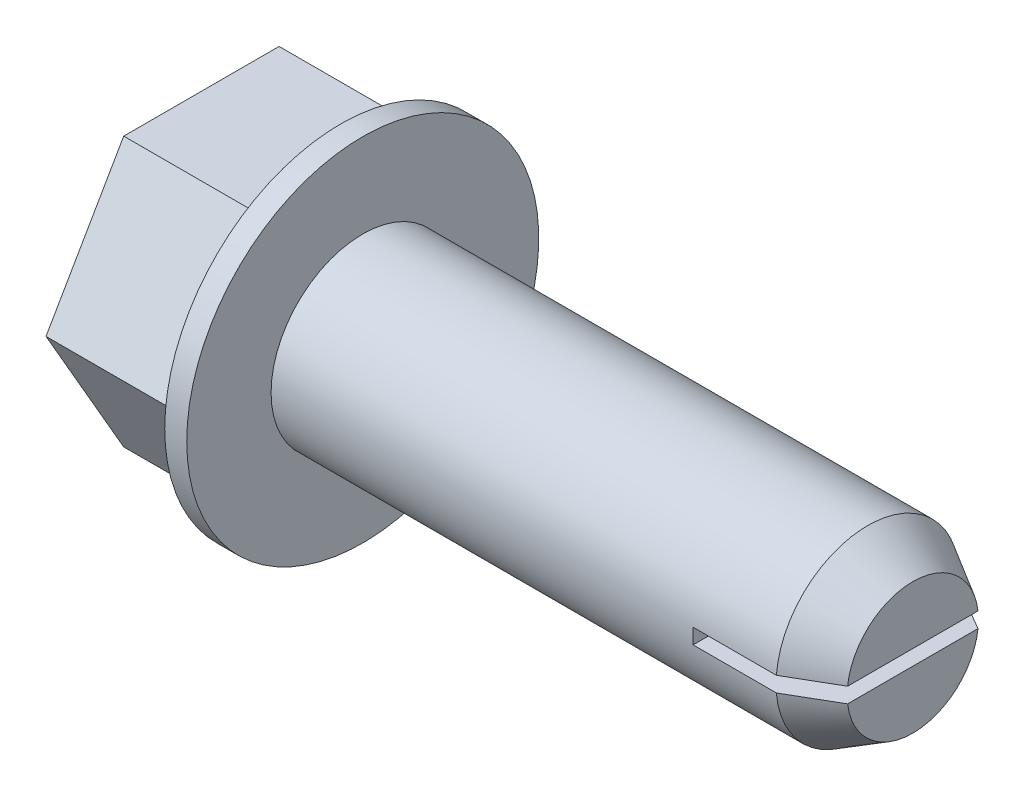
ISO-10303-21;
HEADER;
FILE_DESCRIPTION(('STEP AP214'),'2;1');
FILE_NAME('part.step','',(''),(''),'','','');
FILE_SCHEMA(('AUTOMOTIVE_DESIGN { 1 0 10303 214 1 1 1 1 }'));
ENDSEC;
DATA;
#1=APPLICATION_CONTEXT('core data for automotive mechanical design processes');
#2=APPLICATION_PROTOCOL_DEFINITION('international standard','automotive_design',2000,#1);
#3=PRODUCT_CONTEXT('',#1,'mechanical');
#4=PRODUCT('Part','Part','',(#3));
#5=PRODUCT_RELATED_PRODUCT_CATEGORY('part','',(#4));
#6=PRODUCT_DEFINITION_FORMATION('','',#4);
#7=PRODUCT_DEFINITION_CONTEXT('part definition',#1,'design');
#8=PRODUCT_DEFINITION('design','',#6,#7);
#9=PRODUCT_DEFINITION_SHAPE('','',#8);
#10=(LENGTH_UNIT() NAMED_UNIT(*) SI_UNIT(.MILLI.,.METRE.));
#11=(NAMED_UNIT(*) PLANE_ANGLE_UNIT() SI_UNIT($,.RADIAN.));
#12=(NAMED_UNIT(*) SI_UNIT($,.STERADIAN.) SOLID_ANGLE_UNIT());
#13=UNCERTAINTY_MEASURE_WITH_UNIT(LENGTH_MEASURE(1.E-05),#10,'distance_accuracy_value','');
#14=(GEOMETRIC_REPRESENTATION_CONTEXT(3) GLOBAL_UNCERTAINTY_ASSIGNED_CONTEXT((#13)) GLOBAL_UNIT_ASSIGNED_CONTEXT((#10,
#11,#12)) REPRESENTATION_CONTEXT('',''));
#15=CARTESIAN_POINT('',(0.,0.,0.));
#16=DIRECTION('',(0.,0.,1.));
#17=DIRECTION('',(1.,0.,0.));
#18=AXIS2_PLACEMENT_3D('',#15,#16,#17);
#19=CARTESIAN_POINT('',(-4.6228,3.72872,0.));
#20=DIRECTION('',(1.,0.,0.));
#21=DIRECTION('',(0.,0.,-1.));
#22=AXIS2_PLACEMENT_3D('',#19,#20,#21);
#23=PLANE('',#22);
#24=CARTESIAN_POINT('',(-4.6228,0.,0.));
#25=DIRECTION('',(-1.,0.,0.));
#26=DIRECTION('',(0.,0.,1.));
#27=AXIS2_PLACEMENT_3D('',#24,#25,#26);
#28=CIRCLE('',#27,3.72872);
#29=CARTESIAN_POINT('',(-4.6228,0.,3.72872));
#30=VERTEX_POINT('',#29);
#31=EDGE_CURVE('E20',#30,#30,#28,.T.);
#32=ORIENTED_EDGE('',*,*,#31,.T.);
#33=EDGE_LOOP('',(#32));
#34=FACE_BOUND('',#33,.T.);
#35=ADVANCED_FACE('F17',(#34),#23,.F.);
#36=CARTESIAN_POINT('',(0.,0.,0.));
#37=DIRECTION('',(-1.,0.,0.));
#38=DIRECTION('',(0.,0.,1.));
#39=AXIS2_PLACEMENT_3D('',#36,#37,#38);
#40=CYLINDRICAL_SURFACE('',#39,3.72872);
#41=ORIENTED_EDGE('',*,*,#31,.F.);
#42=EDGE_LOOP('',(#41));
#43=FACE_BOUND('',#42,.T.);
#44=CARTESIAN_POINT('',(-5.588,0.,0.));
#45=DIRECTION('',(-1.,0.,0.));
#46=DIRECTION('',(0.,0.,1.));
#47=AXIS2_PLACEMENT_3D('',#44,#45,#46);
#48=CIRCLE('',#47,3.72872);
#49=CARTESIAN_POINT('',(-5.588,0.,3.72872));
#50=VERTEX_POINT('',#49);
#51=EDGE_CURVE('E125',#50,#50,#48,.T.);
#52=ORIENTED_EDGE('',*,*,#51,.T.);
#53=EDGE_LOOP('',(#52));
#54=FACE_BOUND('',#53,.T.);
#55=ADVANCED_FACE('F212',(#43,#54),#40,.F.);
#56=CARTESIAN_POINT('',(-5.588,4.6609,0.));
#57=DIRECTION('',(1.,0.,0.));
#58=DIRECTION('',(0.,0.,-1.));
#59=AXIS2_PLACEMENT_3D('',#56,#57,#58);
#60=PLANE('',#59);
#61=DIRECTION('',(0.,0.,-1.));
#62=VECTOR('',#61,1.);
#63=CARTESIAN_POINT('',(-5.58799999998882,-4.6609,0.));
#64=LINE('',#63,#62);
#65=CARTESIAN_POINT('',(-5.58800000007968,-4.6609,2.69097186966593));
#66=VERTEX_POINT('',#65);
#67=CARTESIAN_POINT('',(-5.58799999999441,-4.6609,-2.69097186966593));
#68=VERTEX_POINT('',#67);
#69=EDGE_CURVE('E122',#66,#68,#64,.T.);
#70=ORIENTED_EDGE('',*,*,#69,.F.);
#71=DIRECTION('',(0.,-0.866025403784439,-0.5));
#72=VECTOR('',#71,1.);
#73=CARTESIAN_POINT('',(-5.5880000002162,-10.7431892055105,-0.820639440424718));
#74=LINE('',#73,#72);
#75=CARTESIAN_POINT('',(-5.58800000007968,0.,5.38194373933185));
#76=VERTEX_POINT('',#75);
#77=EDGE_CURVE('E117',#76,#66,#74,.T.);
#78=ORIENTED_EDGE('',*,*,#77,.F.);
#79=DIRECTION('',(0.,-0.866025403784439,0.5));
#80=VECTOR('',#79,1.);
#81=CARTESIAN_POINT('',(-5.58799999998882,-6.08228920551051,8.8935550494225));
#82=LINE('',#81,#80);
#83=CARTESIAN_POINT('',(-5.58799999999441,4.6609,2.69097186966593));
#84=VERTEX_POINT('',#83);
#85=EDGE_CURVE('E114',#84,#76,#82,.T.);
#86=ORIENTED_EDGE('',*,*,#85,.F.);
#87=DIRECTION('',(0.,0.,1.));
#88=VECTOR('',#87,1.);
#89=CARTESIAN_POINT('',(-5.58799999998882,4.6609,0.));
#90=LINE('',#89,#88);
#91=CARTESIAN_POINT('',(-5.58800000007968,4.6609,-2.69097186966593));
#92=VERTEX_POINT('',#91);
#93=EDGE_CURVE('E134',#92,#84,#90,.T.);
#94=ORIENTED_EDGE('',*,*,#93,.F.);
#95=DIRECTION('',(0.,0.866025403784439,0.5));
#96=VECTOR('',#95,1.);
#97=CARTESIAN_POINT('',(-5.5880000002162,-6.08228920551051,-8.8935550494225));
#98=LINE('',#97,#96);
#99=CARTESIAN_POINT('',(-5.58800000016215,0.,-5.38194373933185));
#100=VERTEX_POINT('',#99);
#101=EDGE_CURVE('E280',#100,#92,#98,.T.);
#102=ORIENTED_EDGE('',*,*,#101,.F.);
#103=DIRECTION('',(0.,0.866025403784439,-0.5));
#104=VECTOR('',#103,1.);
#105=CARTESIAN_POINT('',(-5.58799999998882,-10.7431892055105,0.82063944042472));
#106=LINE('',#105,#104);
#107=EDGE_CURVE('E272',#68,#100,#106,.T.);
#108=ORIENTED_EDGE('',*,*,#107,.F.);
#109=EDGE_LOOP('',(#70,#78,#86,#94,#102,#108));
#110=FACE_BOUND('',#109,.T.);
#111=ORIENTED_EDGE('',*,*,#51,.F.);
#112=EDGE_LOOP('',(#111));
#113=FACE_BOUND('',#112,.T.);
#114=ADVANCED_FACE('F119',(#110,#113),#60,.F.);
#115=CARTESIAN_POINT('',(500000.,-10.7431892055105,-0.820639440424718));
#116=DIRECTION('',(0.,-0.5,0.866025403784439));
#117=DIRECTION('',(0.,-0.866025403784439,-0.5));
#118=AXIS2_PLACEMENT_3D('',#115,#116,#117);
#119=PLANE('',#118);
#120=DIRECTION('',(0.,0.866025403784439,0.5));
#121=VECTOR('',#120,1.);
#122=CARTESIAN_POINT('',(-0.762,-4.6609,2.69097186966593));
#123=LINE('',#122,#121);
#124=CARTESIAN_POINT('',(-0.762000000091873,-4.6609,2.69097186966593));
#125=VERTEX_POINT('',#124);
#126=CARTESIAN_POINT('',(-0.762000000177139,0.,5.38194373933185));
#127=VERTEX_POINT('',#126);
#128=EDGE_CURVE('E131',#125,#127,#123,.T.);
#129=ORIENTED_EDGE('',*,*,#128,.T.);
#130=DIRECTION('',(1.,0.,0.));
#131=VECTOR('',#130,1.);
#132=CARTESIAN_POINT('',(500000.,0.,5.38194373933185));
#133=LINE('',#132,#131);
#134=EDGE_CURVE('E128',#76,#127,#133,.T.);
#135=ORIENTED_EDGE('',*,*,#134,.F.);
#136=ORIENTED_EDGE('',*,*,#77,.T.);
#137=DIRECTION('',(1.,0.,0.));
#138=VECTOR('',#137,1.);
#139=CARTESIAN_POINT('',(500000.,-4.6609,2.69097186966593));
#140=LINE('',#139,#138);
#141=EDGE_CURVE('E267',#125,#66,#140,.F.);
#142=ORIENTED_EDGE('',*,*,#141,.F.);
#143=EDGE_LOOP('',(#129,#135,#136,#142));
#144=FACE_BOUND('',#143,.T.);
#145=ADVANCED_FACE('F129',(#144),#119,.T.);
#146=CARTESIAN_POINT('',(500000.,-6.08228920551051,8.8935550494225));
#147=DIRECTION('',(0.,0.5,0.866025403784439));
#148=DIRECTION('',(0.,-0.866025403784439,0.5));
#149=AXIS2_PLACEMENT_3D('',#146,#147,#148);
#150=PLANE('',#149);
#151=DIRECTION('',(0.,0.866025403784439,-0.5));
#152=VECTOR('',#151,1.);
#153=CARTESIAN_POINT('',(-0.762,0.,5.38194373933185));
#154=LINE('',#153,#152);
#155=CARTESIAN_POINT('',(-0.762000000006608,4.6609,2.69097186966593));
#156=VERTEX_POINT('',#155);
#157=EDGE_CURVE('E264',#127,#156,#154,.T.);
#158=ORIENTED_EDGE('',*,*,#157,.T.);
#159=DIRECTION('',(1.,0.,0.));
#160=VECTOR('',#159,1.);
#161=CARTESIAN_POINT('',(500000.,4.6609,2.69097186966592));
#162=LINE('',#161,#160);
#163=EDGE_CURVE('E138',#84,#156,#162,.T.);
#164=ORIENTED_EDGE('',*,*,#163,.F.);
#165=ORIENTED_EDGE('',*,*,#85,.T.);
#166=ORIENTED_EDGE('',*,*,#134,.T.);
#167=EDGE_LOOP('',(#158,#164,#165,#166));
#168=FACE_BOUND('',#167,.T.);
#169=ADVANCED_FACE('F136',(#168),#150,.T.);
#170=CARTESIAN_POINT('',(500000.,4.6609,0.));
#171=DIRECTION('',(0.,1.,0.));
#172=DIRECTION('',(0.,0.,1.));
#173=AXIS2_PLACEMENT_3D('',#170,#171,#172);
#174=PLANE('',#173);
#175=DIRECTION('',(0.,0.,-1.));
#176=VECTOR('',#175,1.);
#177=CARTESIAN_POINT('',(-0.762,4.6609,0.));
#178=LINE('',#177,#176);
#179=CARTESIAN_POINT('',(-0.762000000049241,4.6609,-2.69097186966592));
#180=VERTEX_POINT('',#179);
#181=EDGE_CURVE('E262',#156,#180,#178,.T.);
#182=ORIENTED_EDGE('',*,*,#181,.T.);
#183=DIRECTION('',(1.,0.,0.));
#184=VECTOR('',#183,1.);
#185=CARTESIAN_POINT('',(500000.,4.6609,-2.69097186966592));
#186=LINE('',#185,#184);
#187=EDGE_CURVE('E277',#92,#180,#186,.T.);
#188=ORIENTED_EDGE('',*,*,#187,.F.);
#189=ORIENTED_EDGE('',*,*,#93,.T.);
#190=ORIENTED_EDGE('',*,*,#163,.T.);
#191=EDGE_LOOP('',(#182,#188,#189,#190));
#192=FACE_BOUND('',#191,.T.);
#193=ADVANCED_FACE('F285',(#192),#174,.T.);
#194=CARTESIAN_POINT('',(500000.,-6.08228920551051,-8.8935550494225));
#195=DIRECTION('',(0.,0.5,-0.866025403784439));
#196=DIRECTION('',(0.,0.866025403784439,0.5));
#197=AXIS2_PLACEMENT_3D('',#194,#195,#196);
#198=PLANE('',#197);
#199=DIRECTION('',(0.,-0.866025403784439,-0.5));
#200=VECTOR('',#199,1.);
#201=CARTESIAN_POINT('',(-0.762,4.6609,-2.69097186966593));
#202=LINE('',#201,#200);
#203=CARTESIAN_POINT('',(-0.762000000148717,0.,-5.38194373933185));
#204=VERTEX_POINT('',#203);
#205=EDGE_CURVE('E260',#180,#204,#202,.T.);
#206=ORIENTED_EDGE('',*,*,#205,.T.);
#207=DIRECTION('',(1.,0.,0.));
#208=VECTOR('',#207,1.);
#209=CARTESIAN_POINT('',(500000.,0.,-5.38194373933185));
#210=LINE('',#209,#208);
#211=EDGE_CURVE('E275',#100,#204,#210,.T.);
#212=ORIENTED_EDGE('',*,*,#211,.F.);
#213=ORIENTED_EDGE('',*,*,#101,.T.);
#214=ORIENTED_EDGE('',*,*,#187,.T.);
#215=EDGE_LOOP('',(#206,#212,#213,#214));
#216=FACE_BOUND('',#215,.T.);
#217=ADVANCED_FACE('F289',(#216),#198,.T.);
#218=CARTESIAN_POINT('',(500000.,-10.7431892055105,0.82063944042472));
#219=DIRECTION('',(0.,-0.5,-0.866025403784439));
#220=DIRECTION('',(0.,0.866025403784439,-0.5));
#221=AXIS2_PLACEMENT_3D('',#218,#219,#220);
#222=PLANE('',#221);
#223=DIRECTION('',(1.,0.,0.));
#224=VECTOR('',#223,1.);
#225=CARTESIAN_POINT('',(500000.,-4.6609,-2.69097186966593));
#226=LINE('',#225,#224);
#227=CARTESIAN_POINT('',(-0.761999999949765,-4.6609,-2.69097186966593));
#228=VERTEX_POINT('',#227);
#229=EDGE_CURVE('E269',#68,#228,#226,.T.);
#230=ORIENTED_EDGE('',*,*,#229,.F.);
#231=ORIENTED_EDGE('',*,*,#107,.T.);
#232=ORIENTED_EDGE('',*,*,#211,.T.);
#233=DIRECTION('',(0.,-0.866025403784439,0.499999999999999));
#234=VECTOR('',#233,1.);
#235=CARTESIAN_POINT('',(-0.762,0.,-5.38194373933185));
#236=LINE('',#235,#234);
#237=EDGE_CURVE('E81',#204,#228,#236,.T.);
#238=ORIENTED_EDGE('',*,*,#237,.T.);
#239=EDGE_LOOP('',(#230,#231,#232,#238));
#240=FACE_BOUND('',#239,.T.);
#241=ADVANCED_FACE('F291',(#240),#222,.T.);
#242=CARTESIAN_POINT('',(500000.,-4.6609,0.));
#243=DIRECTION('',(0.,-1.,0.));
#244=DIRECTION('',(0.,0.,-1.));
#245=AXIS2_PLACEMENT_3D('',#242,#243,#244);
#246=PLANE('',#245);
#247=DIRECTION('',(0.,0.,-1.));
#248=VECTOR('',#247,1.);
#249=CARTESIAN_POINT('',(-0.762,-4.6609,0.));
#250=LINE('',#249,#248);
#251=EDGE_CURVE('E204',#228,#125,#250,.F.);
#252=ORIENTED_EDGE('',*,*,#251,.T.);
#253=ORIENTED_EDGE('',*,*,#141,.T.);
#254=ORIENTED_EDGE('',*,*,#69,.T.);
#255=ORIENTED_EDGE('',*,*,#229,.T.);
#256=EDGE_LOOP('',(#252,#253,#254,#255));
#257=FACE_BOUND('',#256,.T.);
#258=ADVANCED_FACE('F294',(#257),#246,.T.);
#259=CARTESIAN_POINT('',(-0.762,6.096,0.));
#260=DIRECTION('',(1.,0.,0.));
#261=DIRECTION('',(0.,0.,-1.));
#262=AXIS2_PLACEMENT_3D('',#259,#260,#261);
#263=PLANE('',#262);
#264=CARTESIAN_POINT('',(-0.762,0.,0.));
#265=DIRECTION('',(-1.,0.,0.));
#266=DIRECTION('',(0.,0.,1.));
#267=AXIS2_PLACEMENT_3D('',#264,#265,#266);
#268=CIRCLE('',#267,6.096);
#269=CARTESIAN_POINT('',(-0.762,0.,6.096));
#270=VERTEX_POINT('',#269);
#271=EDGE_CURVE('E202',#270,#270,#268,.F.);
#272=ORIENTED_EDGE('',*,*,#271,.F.);
#273=EDGE_LOOP('',(#272));
#274=FACE_BOUND('',#273,.T.);
#275=ORIENTED_EDGE('',*,*,#237,.F.);
#276=ORIENTED_EDGE('',*,*,#205,.F.);
#277=ORIENTED_EDGE('',*,*,#181,.F.);
#278=ORIENTED_EDGE('',*,*,#157,.F.);
#279=ORIENTED_EDGE('',*,*,#128,.F.);
#280=ORIENTED_EDGE('',*,*,#251,.F.);
#281=EDGE_LOOP('',(#275,#276,#277,#278,#279,#280));
#282=FACE_BOUND('',#281,.T.);
#283=ADVANCED_FACE('F296',(#274,#282),#263,.F.);
#284=CARTESIAN_POINT('',(19.05,3.175,0.));
#285=DIRECTION('',(-1.,0.,0.));
#286=DIRECTION('',(0.,0.,1.));
#287=AXIS2_PLACEMENT_3D('',#284,#285,#286);
#288=PLANE('',#287);
#289=DIRECTION('',(0.,0.,-1.));
#290=VECTOR('',#289,1.);
#291=CARTESIAN_POINT('',(19.05,-0.264583333333333,-6.096));
#292=LINE('',#291,#290);
#293=CARTESIAN_POINT('',(19.0500000000004,-0.264583333333333,-2.25785042680903));
#294=VERTEX_POINT('',#293);
#295=CARTESIAN_POINT('',(19.0499999999965,-0.264583333333333,2.25785042681133));
#296=VERTEX_POINT('',#295);
#297=EDGE_CURVE('E200',#294,#296,#292,.F.);
#298=ORIENTED_EDGE('',*,*,#297,.T.);
#299=CARTESIAN_POINT('',(19.0499999999929,0.,0.));
#300=DIRECTION('',(-1.,0.,0.));
#301=DIRECTION('',(0.,0.,1.));
#302=AXIS2_PLACEMENT_3D('',#299,#300,#301);
#303=CIRCLE('',#302,2.27330000003061);
#304=EDGE_CURVE('E72',#294,#296,#303,.T.);
#305=ORIENTED_EDGE('',*,*,#304,.F.);
#306=EDGE_LOOP('',(#298,#305));
#307=FACE_BOUND('',#306,.T.);
#308=ADVANCED_FACE('F298',(#307),#288,.F.);
#309=CARTESIAN_POINT('',(0.,0.,0.));
#310=DIRECTION('',(-1.,0.,0.));
#311=DIRECTION('',(0.,0.,1.));
#312=AXIS2_PLACEMENT_3D('',#309,#310,#311);
#313=CYLINDRICAL_SURFACE('',#312,6.096);
#314=ORIENTED_EDGE('',*,*,#271,.T.);
#315=EDGE_LOOP('',(#314));
#316=FACE_BOUND('',#315,.T.);
#317=CARTESIAN_POINT('',(0.,0.,0.));
#318=DIRECTION('',(-1.,0.,0.));
#319=DIRECTION('',(0.,0.,1.));
#320=AXIS2_PLACEMENT_3D('',#317,#318,#319);
#321=CIRCLE('',#320,6.096);
#322=CARTESIAN_POINT('',(0.,0.,6.096));
#323=VERTEX_POINT('',#322);
#324=EDGE_CURVE('E240',#323,#323,#321,.T.);
#325=ORIENTED_EDGE('',*,*,#324,.T.);
#326=EDGE_LOOP('',(#325));
#327=FACE_BOUND('',#326,.T.);
#328=ADVANCED_FACE('F305',(#316,#327),#313,.T.);
#329=CARTESIAN_POINT('',(17.488209787075,0.,0.));
#330=DIRECTION('',(-1.,0.,0.));
#331=DIRECTION('',(0.,0.,1.));
#332=AXIS2_PLACEMENT_3D('',#329,#330,#331);
#333=CONICAL_SURFACE('',#332,3.17499999988513,0.523598775602448);
#334=CARTESIAN_POINT('',(17.4882097868304,-0.264583333333333,-3.16395648830533));
#335=CARTESIAN_POINT('',(17.7485950521458,-0.264583333333333,-3.01308870934584));
#336=CARTESIAN_POINT('',(18.0089562455111,-0.264583333333333,-2.86217927282826));
#337=CARTESIAN_POINT('',(18.3994183217583,-0.264583333333333,-2.63567773139847));
#338=CARTESIAN_POINT('',(18.5295590617472,-0.264583333333333,-2.56015431969282));
#339=CARTESIAN_POINT('',(18.7898067189707,-0.264583333333333,-2.40904920796175));
#340=CARTESIAN_POINT('',(18.9199136362009,-0.264583333333333,-2.333467507929));
#341=CARTESIAN_POINT('',(19.0500000000079,-0.264583333333333,-2.25785042680467));
#342=B_SPLINE_CURVE_WITH_KNOTS('',3,(#334,#335,#336,#337,#338,#339,#340,#341),.UNSPECIFIED.,.F.,
.F.,(4,2,2,4),(0.,0.902803568709945,1.35420535449983,1.80560719706211),.UNSPECIFIED.);
#343=CARTESIAN_POINT('',(17.4882097868228,-0.264583333333333,-3.16395648829212));
#344=VERTEX_POINT('',#343);
#345=EDGE_CURVE('E195',#344,#294,#342,.T.);
#346=ORIENTED_EDGE('',*,*,#345,.T.);
#347=ORIENTED_EDGE('',*,*,#304,.T.);
#348=CARTESIAN_POINT('',(19.0500000000073,-0.264583333333333,2.257850426805));
#349=CARTESIAN_POINT('',(18.9199136362004,-0.264583333333333,2.3334675079293));
#350=CARTESIAN_POINT('',(18.7898067189702,-0.264583333333333,2.40904920796202));
#351=CARTESIAN_POINT('',(18.5295590617469,-0.264583333333333,2.56015431969304));
#352=CARTESIAN_POINT('',(18.3994183217579,-0.264583333333333,2.63567773139866));
#353=CARTESIAN_POINT('',(18.0089562455109,-0.264583333333333,2.86217927282837));
#354=CARTESIAN_POINT('',(17.7485950521457,-0.264583333333333,3.01308870934589));
#355=CARTESIAN_POINT('',(17.4882097868304,-0.264583333333333,3.16395648830533));
#356=B_SPLINE_CURVE_WITH_KNOTS('',3,(#348,#349,#350,#351,#352,#353,#354,#355),.UNSPECIFIED.,.F.,
.F.,(4,2,2,4),(0.,0.451401842562117,0.902803628351839,1.80560719706146),.UNSPECIFIED.);
#357=CARTESIAN_POINT('',(17.4882097868228,-0.264583333333333,3.16395648829212));
#358=VERTEX_POINT('',#357);
#359=EDGE_CURVE('E189',#296,#358,#356,.T.);
#360=ORIENTED_EDGE('',*,*,#359,.T.);
#361=CARTESIAN_POINT('',(17.4882097868151,0.,0.));
#362=DIRECTION('',(-1.,0.,0.));
#363=DIRECTION('',(0.,0.,1.));
#364=AXIS2_PLACEMENT_3D('',#361,#362,#363);
#365=CIRCLE('',#364,3.175);
#366=EDGE_CURVE('E249',#344,#358,#365,.T.);
#367=ORIENTED_EDGE('',*,*,#366,.F.);
#368=EDGE_LOOP('',(#346,#347,#360,#367));
#369=FACE_BOUND('',#368,.T.);
#370=ADVANCED_FACE('F183',(#369),#333,.T.);
#371=CARTESIAN_POINT('',(14.605,-0.264583333333333,-6.096));
#372=DIRECTION('',(0.,-1.,0.));
#373=DIRECTION('',(0.,0.,-1.));
#374=AXIS2_PLACEMENT_3D('',#371,#372,#373);
#375=PLANE('',#374);
#376=ORIENTED_EDGE('',*,*,#297,.F.);
#377=ORIENTED_EDGE('',*,*,#345,.F.);
#378=DIRECTION('',(-1.,0.,0.));
#379=VECTOR('',#378,1.);
#380=CARTESIAN_POINT('',(0.,-0.264583333333333,-3.16395648827891));
#381=LINE('',#380,#379);
#382=CARTESIAN_POINT('',(14.605,-0.264583333333333,-3.16395648827891));
#383=VERTEX_POINT('',#382);
#384=EDGE_CURVE('E252',#383,#344,#381,.F.);
#385=ORIENTED_EDGE('',*,*,#384,.F.);
#386=DIRECTION('',(0.,0.,1.));
#387=VECTOR('',#386,1.);
#388=CARTESIAN_POINT('',(14.605,-0.264583333333333,-6.096));
#389=LINE('',#388,#387);
#390=CARTESIAN_POINT('',(14.605,-0.264583333333333,3.16395648827891));
#391=VERTEX_POINT('',#390);
#392=EDGE_CURVE('E238',#383,#391,#389,.T.);
#393=ORIENTED_EDGE('',*,*,#392,.T.);
#394=DIRECTION('',(-1.,0.,0.));
#395=VECTOR('',#394,1.);
#396=CARTESIAN_POINT('',(0.,-0.264583333333333,3.16395648827891));
#397=LINE('',#396,#395);
#398=EDGE_CURVE('E245',#358,#391,#397,.T.);
#399=ORIENTED_EDGE('',*,*,#398,.F.);
#400=ORIENTED_EDGE('',*,*,#359,.F.);
#401=EDGE_LOOP('',(#376,#377,#385,#393,#399,#400));
#402=FACE_BOUND('',#401,.T.);
#403=ADVANCED_FACE('F178',(#402),#375,.F.);
#404=CARTESIAN_POINT('',(14.605,0.264583333333333,-6.096));
#405=DIRECTION('',(-1.,0.,0.));
#406=DIRECTION('',(0.,0.,1.));
#407=AXIS2_PLACEMENT_3D('',#404,#405,#406);
#408=PLANE('',#407);
#409=DIRECTION('',(0.,0.,1.));
#410=VECTOR('',#409,1.);
#411=CARTESIAN_POINT('',(14.605,0.264583333333333,-6.096));
#412=LINE('',#411,#410);
#413=CARTESIAN_POINT('',(14.605,0.264583333333334,-3.16395648827891));
#414=VERTEX_POINT('',#413);
#415=CARTESIAN_POINT('',(14.605,0.264583333333333,3.16395648827891));
#416=VERTEX_POINT('',#415);
#417=EDGE_CURVE('E241',#414,#416,#412,.T.);
#418=ORIENTED_EDGE('',*,*,#417,.T.);
#419=CARTESIAN_POINT('',(14.605,0.,0.));
#420=DIRECTION('',(-1.,0.,0.));
#421=DIRECTION('',(0.,0.,1.));
#422=AXIS2_PLACEMENT_3D('',#419,#420,#421);
#423=CIRCLE('',#422,3.175);
#424=EDGE_CURVE('E248',#391,#416,#423,.T.);
#425=ORIENTED_EDGE('',*,*,#424,.F.);
#426=ORIENTED_EDGE('',*,*,#392,.F.);
#427=CARTESIAN_POINT('',(14.605,0.,0.));
#428=DIRECTION('',(-1.,0.,0.));
#429=DIRECTION('',(0.,0.,1.));
#430=AXIS2_PLACEMENT_3D('',#427,#428,#429);
#431=CIRCLE('',#430,3.175);
#432=EDGE_CURVE('E255',#414,#383,#431,.T.);
#433=ORIENTED_EDGE('',*,*,#432,.F.);
#434=EDGE_LOOP('',(#418,#425,#426,#433));
#435=FACE_BOUND('',#434,.T.);
#436=ADVANCED_FACE('F174',(#435),#408,.F.);
#437=CARTESIAN_POINT('',(19.05,3.175,0.));
#438=DIRECTION('',(-1.,0.,0.));
#439=DIRECTION('',(0.,0.,1.));
#440=AXIS2_PLACEMENT_3D('',#437,#438,#439);
#441=PLANE('',#440);
#442=DIRECTION('',(0.,0.,1.));
#443=VECTOR('',#442,1.);
#444=CARTESIAN_POINT('',(19.05,0.264583333333333,-6.096));
#445=LINE('',#444,#443);
#446=CARTESIAN_POINT('',(19.0500000000004,0.264583333333333,2.25785042680903));
#447=VERTEX_POINT('',#446);
#448=CARTESIAN_POINT('',(19.0499999999965,0.264583333333333,-2.25785042681133));
#449=VERTEX_POINT('',#448);
#450=EDGE_CURVE('E153',#447,#449,#445,.F.);
#451=ORIENTED_EDGE('',*,*,#450,.T.);
#452=CARTESIAN_POINT('',(19.0499999999929,0.,0.));
#453=DIRECTION('',(-1.,0.,0.));
#454=DIRECTION('',(0.,0.,1.));
#455=AXIS2_PLACEMENT_3D('',#452,#453,#454);
#456=CIRCLE('',#455,2.27330000003061);
#457=EDGE_CURVE('E244',#447,#449,#456,.T.);
#458=ORIENTED_EDGE('',*,*,#457,.F.);
#459=EDGE_LOOP('',(#451,#458));
#460=FACE_BOUND('',#459,.T.);
#461=ADVANCED_FACE('F170',(#460),#441,.F.);
#462=CARTESIAN_POINT('',(0.,3.175,0.));
#463=DIRECTION('',(-1.,0.,0.));
#464=DIRECTION('',(0.,0.,1.));
#465=AXIS2_PLACEMENT_3D('',#462,#463,#464);
#466=PLANE('',#465);
#467=CARTESIAN_POINT('',(0.,0.,0.));
#468=DIRECTION('',(-1.,0.,0.));
#469=DIRECTION('',(0.,0.,1.));
#470=AXIS2_PLACEMENT_3D('',#467,#468,#469);
#471=CIRCLE('',#470,3.175);
#472=CARTESIAN_POINT('',(0.,0.,3.175));
#473=VERTEX_POINT('',#472);
#474=EDGE_CURVE('E143',#473,#473,#471,.F.);
#475=ORIENTED_EDGE('',*,*,#474,.F.);
#476=EDGE_LOOP('',(#475));
#477=FACE_BOUND('',#476,.T.);
#478=ORIENTED_EDGE('',*,*,#324,.F.);
#479=EDGE_LOOP('',(#478));
#480=FACE_BOUND('',#479,.T.);
#481=ADVANCED_FACE('F166',(#477,#480),#466,.F.);
#482=CARTESIAN_POINT('',(17.488209787075,0.,0.));
#483=DIRECTION('',(-1.,0.,0.));
#484=DIRECTION('',(0.,0.,1.));
#485=AXIS2_PLACEMENT_3D('',#482,#483,#484);
#486=CONICAL_SURFACE('',#485,3.17499999988513,0.523598775602448);
#487=CARTESIAN_POINT('',(17.4882097868351,0.264583333333333,3.16395648830265));
#488=CARTESIAN_POINT('',(17.7485950521496,0.264583333333333,3.0130887093436));
#489=CARTESIAN_POINT('',(18.0089562455142,0.264583333333333,2.86217927282647));
#490=CARTESIAN_POINT('',(18.3994183217602,0.264583333333333,2.63567773139735));
#491=CARTESIAN_POINT('',(18.5295590617488,0.264583333333333,2.56015431969193));
#492=CARTESIAN_POINT('',(18.7898067189715,0.264583333333333,2.40904920796131));
#493=CARTESIAN_POINT('',(18.9199136362013,0.264583333333333,2.33346750792877));
#494=CARTESIAN_POINT('',(19.0500000000079,0.264583333333333,2.25785042680467));
#495=B_SPLINE_CURVE_WITH_KNOTS('',3,(#487,#488,#489,#490,#491,#492,#493,#494),.UNSPECIFIED.,.F.,
.F.,(4,2,2,4),(0.,0.902803568707271,1.35420535449581,1.80560719705676),.UNSPECIFIED.);
#496=CARTESIAN_POINT('',(17.4882097868251,0.264583333333333,3.16395648829078));
#497=VERTEX_POINT('',#496);
#498=EDGE_CURVE('E154',#497,#447,#495,.T.);
#499=ORIENTED_EDGE('',*,*,#498,.T.);
#500=ORIENTED_EDGE('',*,*,#457,.T.);
#501=CARTESIAN_POINT('',(19.0500000000051,0.264583333333333,-2.25785042680627));
#502=CARTESIAN_POINT('',(18.9199136361991,0.264583333333333,-2.33346750793001));
#503=CARTESIAN_POINT('',(18.7898067189699,0.264583333333333,-2.40904920796219));
#504=CARTESIAN_POINT('',(18.5295590617485,0.264583333333333,-2.5601543196921));
#505=CARTESIAN_POINT('',(18.3994183217605,0.264583333333333,-2.63567773139716));
#506=CARTESIAN_POINT('',(18.0089562455164,0.264583333333333,-2.86217927282522));
#507=CARTESIAN_POINT('',(17.748595052153,0.264583333333333,-3.01308870934164));
#508=CARTESIAN_POINT('',(17.4882097868397,0.264583333333333,-3.16395648829997));
#509=B_SPLINE_CURVE_WITH_KNOTS('',3,(#501,#502,#503,#504,#505,#506,#507,#508),.UNSPECIFIED.,.F.,
.F.,(4,2,2,4),(0.,0.451401842558815,0.902803628345232,1.80560719704824),.UNSPECIFIED.);
#510=CARTESIAN_POINT('',(17.4882097868274,0.264583333333334,-3.16395648828944));
#511=VERTEX_POINT('',#510);
#512=EDGE_CURVE('E35',#449,#511,#509,.T.);
#513=ORIENTED_EDGE('',*,*,#512,.T.);
#514=CARTESIAN_POINT('',(17.4882097868151,0.,0.));
#515=DIRECTION('',(-1.,0.,0.));
#516=DIRECTION('',(0.,0.,1.));
#517=AXIS2_PLACEMENT_3D('',#514,#515,#516);
#518=CIRCLE('',#517,3.175);
#519=EDGE_CURVE('E26',#497,#511,#518,.T.);
#520=ORIENTED_EDGE('',*,*,#519,.F.);
#521=EDGE_LOOP('',(#499,#500,#513,#520));
#522=FACE_BOUND('',#521,.T.);
#523=ADVANCED_FACE('F162',(#522),#486,.T.);
#524=CARTESIAN_POINT('',(14.605,0.264583333333333,-6.096));
#525=DIRECTION('',(0.,1.,0.));
#526=DIRECTION('',(0.,0.,1.));
#527=AXIS2_PLACEMENT_3D('',#524,#525,#526);
#528=PLANE('',#527);
#529=ORIENTED_EDGE('',*,*,#450,.F.);
#530=ORIENTED_EDGE('',*,*,#498,.F.);
#531=DIRECTION('',(-1.,0.,0.));
#532=VECTOR('',#531,1.);
#533=CARTESIAN_POINT('',(0.,0.264583333333334,3.16395648827891));
#534=LINE('',#533,#532);
#535=EDGE_CURVE('E146',#416,#497,#534,.F.);
#536=ORIENTED_EDGE('',*,*,#535,.F.);
#537=ORIENTED_EDGE('',*,*,#417,.F.);
#538=DIRECTION('',(-1.,0.,0.));
#539=VECTOR('',#538,1.);
#540=CARTESIAN_POINT('',(0.,0.264583333333334,-3.16395648827891));
#541=LINE('',#540,#539);
#542=EDGE_CURVE('E11',#511,#414,#541,.T.);
#543=ORIENTED_EDGE('',*,*,#542,.F.);
#544=ORIENTED_EDGE('',*,*,#512,.F.);
#545=EDGE_LOOP('',(#529,#530,#536,#537,#543,#544));
#546=FACE_BOUND('',#545,.T.);
#547=ADVANCED_FACE('F159',(#546),#528,.F.);
#548=CARTESIAN_POINT('',(0.,0.,0.));
#549=DIRECTION('',(-1.,0.,0.));
#550=DIRECTION('',(0.,0.,1.));
#551=AXIS2_PLACEMENT_3D('',#548,#549,#550);
#552=CYLINDRICAL_SURFACE('',#551,3.175);
#553=ORIENTED_EDGE('',*,*,#474,.T.);
#554=EDGE_LOOP('',(#553));
#555=FACE_BOUND('',#554,.T.);
#556=ORIENTED_EDGE('',*,*,#519,.T.);
#557=ORIENTED_EDGE('',*,*,#542,.T.);
#558=ORIENTED_EDGE('',*,*,#432,.T.);
#559=ORIENTED_EDGE('',*,*,#384,.T.);
#560=ORIENTED_EDGE('',*,*,#366,.T.);
#561=ORIENTED_EDGE('',*,*,#398,.T.);
#562=ORIENTED_EDGE('',*,*,#424,.T.);
#563=ORIENTED_EDGE('',*,*,#535,.T.);
#564=EDGE_LOOP('',(#556,#557,#558,#559,#560,#561,#562,#563));
#565=FACE_BOUND('',#564,.T.);
#566=ADVANCED_FACE('F220',(#555,#565),#552,.T.);
#567=CLOSED_SHELL('',(#35,#55,#114,#145,#169,#193,#217,#241,#258,#283,#308,#328,#370,#403,#436,
#461,#481,#523,#547,#566));
#568=MANIFOLD_SOLID_BREP('B1',#567);
#569=ADVANCED_BREP_SHAPE_REPRESENTATION('',(#18,#568),#14);
#570=SHAPE_DEFINITION_REPRESENTATION(#9,#569);
ENDSEC;
END-ISO-10303-21;
